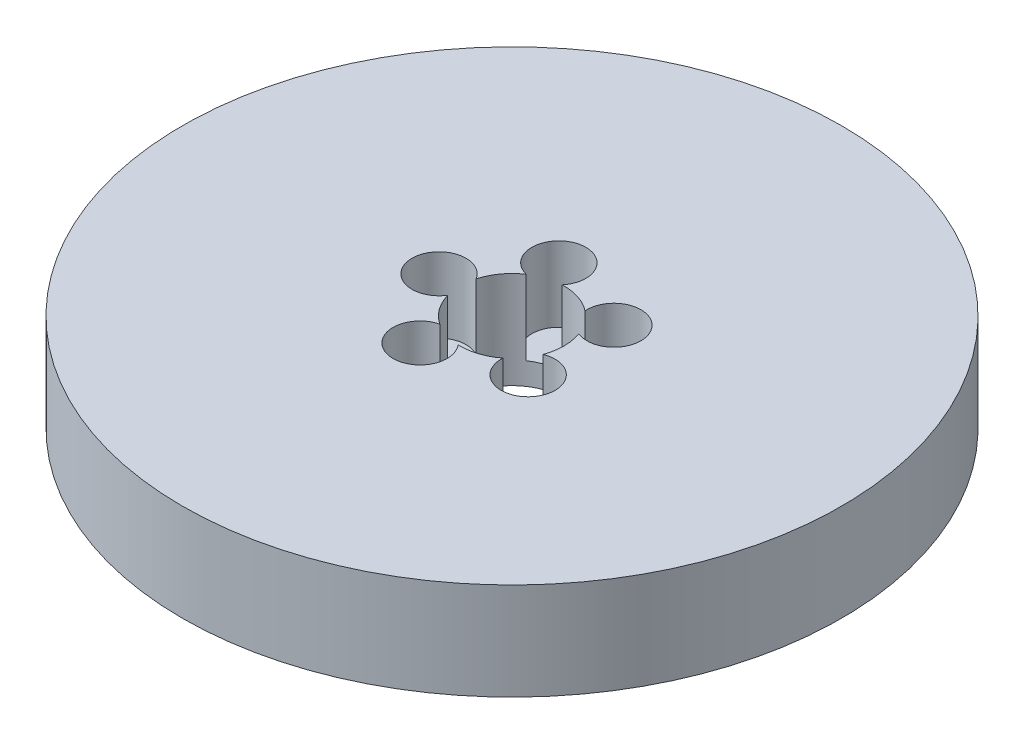
ISO-10303-21;
HEADER;
FILE_DESCRIPTION(('STEP AP214'),'2;1');
FILE_NAME('part.step','',(''),(''),'','','');
FILE_SCHEMA(('AUTOMOTIVE_DESIGN { 1 0 10303 214 1 1 1 1 }'));
ENDSEC;
DATA;
#1=APPLICATION_CONTEXT('core data for automotive mechanical design processes');
#2=APPLICATION_PROTOCOL_DEFINITION('international standard','automotive_design',2000,#1);
#3=PRODUCT_CONTEXT('',#1,'mechanical');
#4=PRODUCT('Part','Part','',(#3));
#5=PRODUCT_RELATED_PRODUCT_CATEGORY('part','',(#4));
#6=PRODUCT_DEFINITION_FORMATION('','',#4);
#7=PRODUCT_DEFINITION_CONTEXT('part definition',#1,'design');
#8=PRODUCT_DEFINITION('design','',#6,#7);
#9=PRODUCT_DEFINITION_SHAPE('','',#8);
#10=(LENGTH_UNIT() NAMED_UNIT(*) SI_UNIT(.MILLI.,.METRE.));
#11=(NAMED_UNIT(*) PLANE_ANGLE_UNIT() SI_UNIT($,.RADIAN.));
#12=(NAMED_UNIT(*) SI_UNIT($,.STERADIAN.) SOLID_ANGLE_UNIT());
#13=UNCERTAINTY_MEASURE_WITH_UNIT(LENGTH_MEASURE(1.E-05),#10,'distance_accuracy_value','');
#14=(GEOMETRIC_REPRESENTATION_CONTEXT(3) GLOBAL_UNCERTAINTY_ASSIGNED_CONTEXT((#13)) GLOBAL_UNIT_ASSIGNED_CONTEXT((#10,
#11,#12)) REPRESENTATION_CONTEXT('',''));
#15=CARTESIAN_POINT('',(0.,0.,0.));
#16=DIRECTION('',(0.,0.,1.));
#17=DIRECTION('',(1.,0.,0.));
#18=AXIS2_PLACEMENT_3D('',#15,#16,#17);
#19=CARTESIAN_POINT('',(0.,14.,0.));
#20=DIRECTION('',(0.,-1.,0.));
#21=DIRECTION('',(0.,0.,-1.));
#22=AXIS2_PLACEMENT_3D('',#19,#20,#21);
#23=CYLINDRICAL_SURFACE('',#22,47.5);
#24=CARTESIAN_POINT('',(0.,14.,0.));
#25=DIRECTION('',(0.,1.,0.));
#26=DIRECTION('',(0.,0.,1.));
#27=AXIS2_PLACEMENT_3D('',#24,#25,#26);
#28=CIRCLE('',#27,47.5);
#29=CARTESIAN_POINT('',(0.,14.,47.5));
#30=VERTEX_POINT('',#29);
#31=EDGE_CURVE('E157',#30,#30,#28,.T.);
#32=ORIENTED_EDGE('',*,*,#31,.F.);
#33=EDGE_LOOP('',(#32));
#34=FACE_BOUND('',#33,.T.);
#35=CARTESIAN_POINT('',(0.,0.,0.));
#36=DIRECTION('',(0.,1.,0.));
#37=DIRECTION('',(0.,0.,1.));
#38=AXIS2_PLACEMENT_3D('',#35,#36,#37);
#39=CIRCLE('',#38,47.5);
#40=CARTESIAN_POINT('',(0.,0.,47.5));
#41=VERTEX_POINT('',#40);
#42=EDGE_CURVE('E150',#41,#41,#39,.T.);
#43=ORIENTED_EDGE('',*,*,#42,.T.);
#44=EDGE_LOOP('',(#43));
#45=FACE_BOUND('',#44,.T.);
#46=ADVANCED_FACE('F39',(#34,#45),#23,.T.);
#47=CARTESIAN_POINT('',(0.,14.,0.));
#48=DIRECTION('',(0.,1.,0.));
#49=DIRECTION('',(0.,0.,1.));
#50=AXIS2_PLACEMENT_3D('',#47,#48,#49);
#51=PLANE('',#50);
#52=CARTESIAN_POINT('',(-3.24953822460557,14.,-10.0010502972899));
#53=DIRECTION('',(0.,1.,0.));
#54=DIRECTION('',(-0.95105651629515,0.,0.309016994374958));
#55=AXIS2_PLACEMENT_3D('',#52,#53,#54);
#56=CIRCLE('',#55,3.89176297593726);
#57=CARTESIAN_POINT('',(-0.271977752933179,14.,-7.49506691777394));
#58=VERTEX_POINT('',#57);
#59=CARTESIAN_POINT('',(-4.18545517499802,14.,-6.22350102258225));
#60=VERTEX_POINT('',#59);
#61=EDGE_CURVE('E194',#58,#60,#56,.T.);
#62=ORIENTED_EDGE('',*,*,#61,.F.);
#63=CARTESIAN_POINT('',(0.,14.,0.));
#64=DIRECTION('',(0.,1.,0.));
#65=DIRECTION('',(0.,0.,1.));
#66=AXIS2_PLACEMENT_3D('',#63,#64,#65);
#67=CIRCLE('',#66,7.5);
#68=CARTESIAN_POINT('',(4.62552442342746,14.,-5.9037719983309));
#69=VERTEX_POINT('',#68);
#70=EDGE_CURVE('E147',#69,#58,#67,.T.);
#71=ORIENTED_EDGE('',*,*,#70,.F.);
#72=CARTESIAN_POINT('',(8.50740151975902,14.,-6.18098900692248));
#73=DIRECTION('',(0.,1.,0.));
#74=DIRECTION('',(-0.58778525229248,0.,-0.809016994374942));
#75=AXIS2_PLACEMENT_3D('',#72,#73,#74);
#76=CIRCLE('',#75,3.89176297593726);
#77=CARTESIAN_POINT('',(7.04418648446888,14.,-2.574769265784));
#78=VERTEX_POINT('',#77);
#79=EDGE_CURVE('E254',#78,#69,#76,.T.);
#80=ORIENTED_EDGE('',*,*,#79,.F.);
#81=CARTESIAN_POINT('',(7.04418648446892,14.,2.5747692657839));
#82=VERTEX_POINT('',#81);
#83=EDGE_CURVE('E144',#82,#78,#67,.T.);
#84=ORIENTED_EDGE('',*,*,#83,.F.);
#85=CARTESIAN_POINT('',(8.50740151975911,14.,6.18098900692236));
#86=DIRECTION('',(0.,1.,0.));
#87=DIRECTION('',(0.587785252292469,0.,-0.809016994374951));
#88=AXIS2_PLACEMENT_3D('',#85,#86,#87);
#89=CIRCLE('',#88,3.89176297593726);
#90=CARTESIAN_POINT('',(4.62552442342755,14.,5.90377199833083));
#91=VERTEX_POINT('',#90);
#92=EDGE_CURVE('E141',#91,#82,#89,.T.);
#93=ORIENTED_EDGE('',*,*,#92,.F.);
#94=CARTESIAN_POINT('',(-0.271977752933075,14.,7.49506691777395));
#95=VERTEX_POINT('',#94);
#96=EDGE_CURVE('E134',#95,#91,#67,.T.);
#97=ORIENTED_EDGE('',*,*,#96,.F.);
#98=CARTESIAN_POINT('',(-3.24953822460543,14.,10.0010502972899));
#99=DIRECTION('',(0.,1.,0.));
#100=DIRECTION('',(0.951056516295155,0.,0.309016994374945));
#101=AXIS2_PLACEMENT_3D('',#98,#99,#100);
#102=CIRCLE('',#101,3.89176297593726);
#103=CARTESIAN_POINT('',(-4.18545517499793,14.,6.22350102258231));
#104=VERTEX_POINT('',#103);
#105=EDGE_CURVE('E111',#104,#95,#102,.T.);
#106=ORIENTED_EDGE('',*,*,#105,.F.);
#107=CARTESIAN_POINT('',(-7.21227797996538,14.,2.05743683735527));
#108=VERTEX_POINT('',#107);
#109=EDGE_CURVE('E145',#108,#104,#67,.T.);
#110=ORIENTED_EDGE('',*,*,#109,.F.);
#111=CARTESIAN_POINT('',(-10.5157265903072,14.,0.));
#112=DIRECTION('',(0.,1.,0.));
#113=DIRECTION('',(0.,0.,1.));
#114=AXIS2_PLACEMENT_3D('',#111,#112,#113);
#115=CIRCLE('',#114,3.89176297593726);
#116=CARTESIAN_POINT('',(-7.21227797996538,14.,-2.05743683735527));
#117=VERTEX_POINT('',#116);
#118=EDGE_CURVE('E153',#117,#108,#115,.T.);
#119=ORIENTED_EDGE('',*,*,#118,.F.);
#120=EDGE_CURVE('E146',#60,#117,#67,.T.);
#121=ORIENTED_EDGE('',*,*,#120,.F.);
#122=EDGE_LOOP('',(#62,#71,#80,#84,#93,#97,#106,#110,#119,#121));
#123=FACE_BOUND('',#122,.T.);
#124=ORIENTED_EDGE('',*,*,#31,.T.);
#125=EDGE_LOOP('',(#124));
#126=FACE_BOUND('',#125,.T.);
#127=ADVANCED_FACE('F139',(#123,#126),#51,.T.);
#128=CARTESIAN_POINT('',(0.,0.,0.));
#129=DIRECTION('',(0.,1.,0.));
#130=DIRECTION('',(0.,0.,1.));
#131=AXIS2_PLACEMENT_3D('',#128,#129,#130);
#132=PLANE('',#131);
#133=CARTESIAN_POINT('',(0.,0.,0.));
#134=DIRECTION('',(0.,1.,0.));
#135=DIRECTION('',(0.,0.,1.));
#136=AXIS2_PLACEMENT_3D('',#133,#134,#135);
#137=CIRCLE('',#136,7.5);
#138=CARTESIAN_POINT('',(0.,0.,7.5));
#139=VERTEX_POINT('',#138);
#140=EDGE_CURVE('E154',#139,#139,#137,.T.);
#141=ORIENTED_EDGE('',*,*,#140,.T.);
#142=EDGE_LOOP('',(#141));
#143=FACE_BOUND('',#142,.T.);
#144=ORIENTED_EDGE('',*,*,#42,.F.);
#145=EDGE_LOOP('',(#144));
#146=FACE_BOUND('',#145,.T.);
#147=ADVANCED_FACE('F213',(#143,#146),#132,.F.);
#148=CARTESIAN_POINT('',(0.,14.,0.));
#149=DIRECTION('',(0.,-1.,0.));
#150=DIRECTION('',(0.,0.,-1.));
#151=AXIS2_PLACEMENT_3D('',#148,#149,#150);
#152=CYLINDRICAL_SURFACE('',#151,7.5);
#153=DIRECTION('',(0.,1.,0.));
#154=VECTOR('',#153,1.);
#155=CARTESIAN_POINT('',(-0.271977752933179,8.60393359361636,-7.49506691777395));
#156=LINE('',#155,#154);
#157=CARTESIAN_POINT('',(-0.271977752933179,3.20786718723272,-7.49506691777394));
#158=VERTEX_POINT('',#157);
#159=EDGE_CURVE('E11',#158,#58,#156,.T.);
#160=ORIENTED_EDGE('',*,*,#159,.F.);
#161=CARTESIAN_POINT('',(0.,3.20786718723272,0.));
#162=DIRECTION('',(0.,1.,0.));
#163=DIRECTION('',(0.,0.,1.));
#164=AXIS2_PLACEMENT_3D('',#161,#162,#163);
#165=CIRCLE('',#164,7.5);
#166=CARTESIAN_POINT('',(-4.18545517499802,3.20786718723272,-6.22350102258225));
#167=VERTEX_POINT('',#166);
#168=EDGE_CURVE('E189',#158,#167,#165,.T.);
#169=ORIENTED_EDGE('',*,*,#168,.T.);
#170=DIRECTION('',(0.,1.,0.));
#171=VECTOR('',#170,1.);
#172=CARTESIAN_POINT('',(-4.18545517499802,8.60393359361636,-6.22350102258225));
#173=LINE('',#172,#171);
#174=EDGE_CURVE('E46',#60,#167,#173,.F.);
#175=ORIENTED_EDGE('',*,*,#174,.F.);
#176=ORIENTED_EDGE('',*,*,#120,.T.);
#177=DIRECTION('',(0.,1.,0.));
#178=VECTOR('',#177,1.);
#179=CARTESIAN_POINT('',(-7.21227797996538,8.60393359361636,-2.05743683735528));
#180=LINE('',#179,#178);
#181=CARTESIAN_POINT('',(-7.21227797996538,3.20786718723272,-2.05743683735527));
#182=VERTEX_POINT('',#181);
#183=EDGE_CURVE('E168',#182,#117,#180,.T.);
#184=ORIENTED_EDGE('',*,*,#183,.F.);
#185=CARTESIAN_POINT('',(0.,3.20786718723272,0.));
#186=DIRECTION('',(0.,1.,0.));
#187=DIRECTION('',(0.,0.,1.));
#188=AXIS2_PLACEMENT_3D('',#185,#186,#187);
#189=CIRCLE('',#188,7.5);
#190=CARTESIAN_POINT('',(-7.21227797996538,3.20786718723272,2.05743683735527));
#191=VERTEX_POINT('',#190);
#192=EDGE_CURVE('E165',#182,#191,#189,.T.);
#193=ORIENTED_EDGE('',*,*,#192,.T.);
#194=DIRECTION('',(0.,1.,0.));
#195=VECTOR('',#194,1.);
#196=CARTESIAN_POINT('',(-7.21227797996538,8.60393359361636,2.05743683735528));
#197=LINE('',#196,#195);
#198=EDGE_CURVE('E170',#108,#191,#197,.F.);
#199=ORIENTED_EDGE('',*,*,#198,.F.);
#200=ORIENTED_EDGE('',*,*,#109,.T.);
#201=DIRECTION('',(0.,1.,0.));
#202=VECTOR('',#201,1.);
#203=CARTESIAN_POINT('',(-4.18545517499792,8.60393359361636,6.22350102258231));
#204=LINE('',#203,#202);
#205=CARTESIAN_POINT('',(-4.18545517499793,3.20786718723272,6.22350102258231));
#206=VERTEX_POINT('',#205);
#207=EDGE_CURVE('E121',#206,#104,#204,.T.);
#208=ORIENTED_EDGE('',*,*,#207,.F.);
#209=CARTESIAN_POINT('',(0.,3.20786718723272,0.));
#210=DIRECTION('',(0.,1.,0.));
#211=DIRECTION('',(0.,0.,1.));
#212=AXIS2_PLACEMENT_3D('',#209,#210,#211);
#213=CIRCLE('',#212,7.5);
#214=CARTESIAN_POINT('',(-0.271977752933075,3.20786718723272,7.49506691777395));
#215=VERTEX_POINT('',#214);
#216=EDGE_CURVE('E136',#206,#215,#213,.T.);
#217=ORIENTED_EDGE('',*,*,#216,.T.);
#218=DIRECTION('',(0.,1.,0.));
#219=VECTOR('',#218,1.);
#220=CARTESIAN_POINT('',(-0.271977752933076,8.60393359361636,7.49506691777395));
#221=LINE('',#220,#219);
#222=EDGE_CURVE('E117',#95,#215,#221,.F.);
#223=ORIENTED_EDGE('',*,*,#222,.F.);
#224=ORIENTED_EDGE('',*,*,#96,.T.);
#225=DIRECTION('',(0.,1.,0.));
#226=VECTOR('',#225,1.);
#227=CARTESIAN_POINT('',(4.62552442342755,8.60393359361636,5.90377199833083));
#228=LINE('',#227,#226);
#229=CARTESIAN_POINT('',(4.62552442342755,3.20786718723272,5.90377199833083));
#230=VERTEX_POINT('',#229);
#231=EDGE_CURVE('E182',#230,#91,#228,.T.);
#232=ORIENTED_EDGE('',*,*,#231,.F.);
#233=CARTESIAN_POINT('',(0.,3.20786718723272,0.));
#234=DIRECTION('',(0.,1.,0.));
#235=DIRECTION('',(0.,0.,1.));
#236=AXIS2_PLACEMENT_3D('',#233,#234,#235);
#237=CIRCLE('',#236,7.5);
#238=CARTESIAN_POINT('',(7.04418648446892,3.20786718723272,2.5747692657839));
#239=VERTEX_POINT('',#238);
#240=EDGE_CURVE('E174',#230,#239,#237,.T.);
#241=ORIENTED_EDGE('',*,*,#240,.T.);
#242=DIRECTION('',(0.,1.,0.));
#243=VECTOR('',#242,1.);
#244=CARTESIAN_POINT('',(7.04418648446892,8.60393359361636,2.5747692657839));
#245=LINE('',#244,#243);
#246=EDGE_CURVE('E177',#82,#239,#245,.F.);
#247=ORIENTED_EDGE('',*,*,#246,.F.);
#248=ORIENTED_EDGE('',*,*,#83,.T.);
#249=DIRECTION('',(0.,1.,0.));
#250=VECTOR('',#249,1.);
#251=CARTESIAN_POINT('',(7.04418648446889,8.60393359361636,-2.574769265784));
#252=LINE('',#251,#250);
#253=CARTESIAN_POINT('',(7.04418648446888,3.20786718723272,-2.574769265784));
#254=VERTEX_POINT('',#253);
#255=EDGE_CURVE('E187',#254,#78,#252,.T.);
#256=ORIENTED_EDGE('',*,*,#255,.F.);
#257=CARTESIAN_POINT('',(0.,3.20786718723272,0.));
#258=DIRECTION('',(0.,1.,0.));
#259=DIRECTION('',(0.,0.,1.));
#260=AXIS2_PLACEMENT_3D('',#257,#258,#259);
#261=CIRCLE('',#260,7.5);
#262=CARTESIAN_POINT('',(4.62552442342746,3.20786718723272,-5.9037719983309));
#263=VERTEX_POINT('',#262);
#264=EDGE_CURVE('E181',#254,#263,#261,.T.);
#265=ORIENTED_EDGE('',*,*,#264,.T.);
#266=DIRECTION('',(0.,1.,0.));
#267=VECTOR('',#266,1.);
#268=CARTESIAN_POINT('',(4.62552442342746,8.60393359361636,-5.9037719983309));
#269=LINE('',#268,#267);
#270=EDGE_CURVE('E186',#69,#263,#269,.F.);
#271=ORIENTED_EDGE('',*,*,#270,.F.);
#272=ORIENTED_EDGE('',*,*,#70,.T.);
#273=EDGE_LOOP('',(#160,#169,#175,#176,#184,#193,#199,#200,#208,#217,#223,#224,#232,#241,#247,
#248,#256,#265,#271,#272));
#274=FACE_BOUND('',#273,.T.);
#275=ORIENTED_EDGE('',*,*,#140,.F.);
#276=EDGE_LOOP('',(#275));
#277=FACE_BOUND('',#276,.T.);
#278=ADVANCED_FACE('F135',(#274,#277),#152,.F.);
#279=CARTESIAN_POINT('',(-10.5157265903072,3.20786718723272,0.));
#280=DIRECTION('',(0.,1.,0.));
#281=DIRECTION('',(0.,0.,1.));
#282=AXIS2_PLACEMENT_3D('',#279,#280,#281);
#283=CYLINDRICAL_SURFACE('',#282,3.89176297593726);
#284=ORIENTED_EDGE('',*,*,#183,.T.);
#285=ORIENTED_EDGE('',*,*,#118,.T.);
#286=ORIENTED_EDGE('',*,*,#198,.T.);
#287=CARTESIAN_POINT('',(-10.5157265903072,3.20786718723272,0.));
#288=DIRECTION('',(0.,1.,0.));
#289=DIRECTION('',(0.,0.,1.));
#290=AXIS2_PLACEMENT_3D('',#287,#288,#289);
#291=CIRCLE('',#290,3.89176297593726);
#292=EDGE_CURVE('E158',#182,#191,#291,.T.);
#293=ORIENTED_EDGE('',*,*,#292,.F.);
#294=EDGE_LOOP('',(#284,#285,#286,#293));
#295=FACE_BOUND('',#294,.T.);
#296=ADVANCED_FACE('F221',(#295),#283,.F.);
#297=CARTESIAN_POINT('',(-10.5157265903072,3.20786718723272,0.));
#298=DIRECTION('',(0.,1.,0.));
#299=DIRECTION('',(0.,0.,1.));
#300=AXIS2_PLACEMENT_3D('',#297,#298,#299);
#301=PLANE('',#300);
#302=ORIENTED_EDGE('',*,*,#292,.T.);
#303=ORIENTED_EDGE('',*,*,#192,.F.);
#304=EDGE_LOOP('',(#302,#303));
#305=FACE_BOUND('',#304,.T.);
#306=ADVANCED_FACE('F227',(#305),#301,.T.);
#307=CARTESIAN_POINT('',(-3.24953822460543,3.20786718723272,10.0010502972899));
#308=DIRECTION('',(0.,1.,0.));
#309=DIRECTION('',(0.,0.,1.));
#310=AXIS2_PLACEMENT_3D('',#307,#308,#309);
#311=CYLINDRICAL_SURFACE('',#310,3.89176297593726);
#312=ORIENTED_EDGE('',*,*,#207,.T.);
#313=ORIENTED_EDGE('',*,*,#105,.T.);
#314=ORIENTED_EDGE('',*,*,#222,.T.);
#315=CARTESIAN_POINT('',(-3.24953822460543,3.20786718723272,10.0010502972899));
#316=DIRECTION('',(0.,1.,0.));
#317=DIRECTION('',(0.951056516295155,0.,0.309016994374945));
#318=AXIS2_PLACEMENT_3D('',#315,#316,#317);
#319=CIRCLE('',#318,3.89176297593726);
#320=EDGE_CURVE('E127',#206,#215,#319,.T.);
#321=ORIENTED_EDGE('',*,*,#320,.F.);
#322=EDGE_LOOP('',(#312,#313,#314,#321));
#323=FACE_BOUND('',#322,.T.);
#324=ADVANCED_FACE('F116',(#323),#311,.F.);
#325=CARTESIAN_POINT('',(-3.24953822460543,3.20786718723272,10.0010502972899));
#326=DIRECTION('',(0.,1.,0.));
#327=DIRECTION('',(0.951056516295155,0.,0.309016994374945));
#328=AXIS2_PLACEMENT_3D('',#325,#326,#327);
#329=PLANE('',#328);
#330=ORIENTED_EDGE('',*,*,#320,.T.);
#331=ORIENTED_EDGE('',*,*,#216,.F.);
#332=EDGE_LOOP('',(#330,#331));
#333=FACE_BOUND('',#332,.T.);
#334=ADVANCED_FACE('F234',(#333),#329,.T.);
#335=CARTESIAN_POINT('',(8.50740151975911,3.20786718723272,6.18098900692236));
#336=DIRECTION('',(0.,1.,0.));
#337=DIRECTION('',(0.,0.,1.));
#338=AXIS2_PLACEMENT_3D('',#335,#336,#337);
#339=CYLINDRICAL_SURFACE('',#338,3.89176297593726);
#340=ORIENTED_EDGE('',*,*,#231,.T.);
#341=ORIENTED_EDGE('',*,*,#92,.T.);
#342=ORIENTED_EDGE('',*,*,#246,.T.);
#343=CARTESIAN_POINT('',(8.50740151975911,3.20786718723272,6.18098900692236));
#344=DIRECTION('',(0.,1.,0.));
#345=DIRECTION('',(0.587785252292469,0.,-0.809016994374951));
#346=AXIS2_PLACEMENT_3D('',#343,#344,#345);
#347=CIRCLE('',#346,3.89176297593726);
#348=EDGE_CURVE('E130',#230,#239,#347,.T.);
#349=ORIENTED_EDGE('',*,*,#348,.F.);
#350=EDGE_LOOP('',(#340,#341,#342,#349));
#351=FACE_BOUND('',#350,.T.);
#352=ADVANCED_FACE('F240',(#351),#339,.F.);
#353=CARTESIAN_POINT('',(8.50740151975911,3.20786718723272,6.18098900692236));
#354=DIRECTION('',(0.,1.,0.));
#355=DIRECTION('',(0.587785252292469,0.,-0.809016994374951));
#356=AXIS2_PLACEMENT_3D('',#353,#354,#355);
#357=PLANE('',#356);
#358=ORIENTED_EDGE('',*,*,#348,.T.);
#359=ORIENTED_EDGE('',*,*,#240,.F.);
#360=EDGE_LOOP('',(#358,#359));
#361=FACE_BOUND('',#360,.T.);
#362=ADVANCED_FACE('F245',(#361),#357,.T.);
#363=CARTESIAN_POINT('',(8.50740151975902,3.20786718723272,-6.18098900692248));
#364=DIRECTION('',(0.,1.,0.));
#365=DIRECTION('',(0.,0.,1.));
#366=AXIS2_PLACEMENT_3D('',#363,#364,#365);
#367=CYLINDRICAL_SURFACE('',#366,3.89176297593726);
#368=ORIENTED_EDGE('',*,*,#255,.T.);
#369=ORIENTED_EDGE('',*,*,#79,.T.);
#370=ORIENTED_EDGE('',*,*,#270,.T.);
#371=CARTESIAN_POINT('',(8.50740151975902,3.20786718723272,-6.18098900692248));
#372=DIRECTION('',(0.,1.,0.));
#373=DIRECTION('',(-0.58778525229248,0.,-0.809016994374942));
#374=AXIS2_PLACEMENT_3D('',#371,#372,#373);
#375=CIRCLE('',#374,3.89176297593726);
#376=EDGE_CURVE('E56',#254,#263,#375,.T.);
#377=ORIENTED_EDGE('',*,*,#376,.F.);
#378=EDGE_LOOP('',(#368,#369,#370,#377));
#379=FACE_BOUND('',#378,.T.);
#380=ADVANCED_FACE('F266',(#379),#367,.F.);
#381=CARTESIAN_POINT('',(8.50740151975902,3.20786718723272,-6.18098900692248));
#382=DIRECTION('',(0.,1.,0.));
#383=DIRECTION('',(-0.58778525229248,0.,-0.809016994374942));
#384=AXIS2_PLACEMENT_3D('',#381,#382,#383);
#385=PLANE('',#384);
#386=ORIENTED_EDGE('',*,*,#376,.T.);
#387=ORIENTED_EDGE('',*,*,#264,.F.);
#388=EDGE_LOOP('',(#386,#387));
#389=FACE_BOUND('',#388,.T.);
#390=ADVANCED_FACE('F204',(#389),#385,.T.);
#391=CARTESIAN_POINT('',(-3.24953822460557,3.20786718723272,-10.0010502972899));
#392=DIRECTION('',(0.,1.,0.));
#393=DIRECTION('',(0.,0.,1.));
#394=AXIS2_PLACEMENT_3D('',#391,#392,#393);
#395=CYLINDRICAL_SURFACE('',#394,3.89176297593726);
#396=ORIENTED_EDGE('',*,*,#159,.T.);
#397=ORIENTED_EDGE('',*,*,#61,.T.);
#398=ORIENTED_EDGE('',*,*,#174,.T.);
#399=CARTESIAN_POINT('',(-3.24953822460557,3.20786718723272,-10.0010502972899));
#400=DIRECTION('',(0.,1.,0.));
#401=DIRECTION('',(-0.95105651629515,0.,0.309016994374958));
#402=AXIS2_PLACEMENT_3D('',#399,#400,#401);
#403=CIRCLE('',#402,3.89176297593726);
#404=EDGE_CURVE('E55',#158,#167,#403,.T.);
#405=ORIENTED_EDGE('',*,*,#404,.F.);
#406=EDGE_LOOP('',(#396,#397,#398,#405));
#407=FACE_BOUND('',#406,.T.);
#408=ADVANCED_FACE('F193',(#407),#395,.F.);
#409=CARTESIAN_POINT('',(-3.24953822460557,3.20786718723272,-10.0010502972899));
#410=DIRECTION('',(0.,1.,0.));
#411=DIRECTION('',(-0.95105651629515,0.,0.309016994374958));
#412=AXIS2_PLACEMENT_3D('',#409,#410,#411);
#413=PLANE('',#412);
#414=ORIENTED_EDGE('',*,*,#404,.T.);
#415=ORIENTED_EDGE('',*,*,#168,.F.);
#416=EDGE_LOOP('',(#414,#415));
#417=FACE_BOUND('',#416,.T.);
#418=ADVANCED_FACE('F196',(#417),#413,.T.);
#419=CLOSED_SHELL('',(#46,#127,#147,#278,#296,#306,#324,#334,#352,#362,#380,#390,#408,#418));
#420=MANIFOLD_SOLID_BREP('B2',#419);
#421=ADVANCED_BREP_SHAPE_REPRESENTATION('',(#18,#420),#14);
#422=SHAPE_DEFINITION_REPRESENTATION(#9,#421);
ENDSEC;
END-ISO-10303-21;
